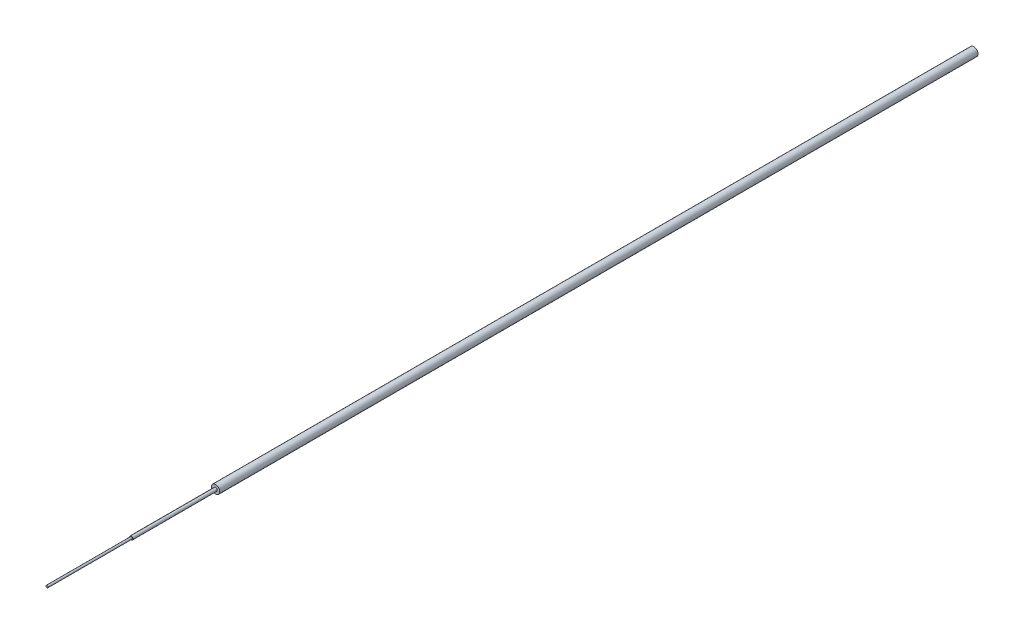
ISO-10303-21;
HEADER;
FILE_DESCRIPTION(('STEP AP214'),'2;1');
FILE_NAME('part.step','',(''),(''),'','','');
FILE_SCHEMA(('AUTOMOTIVE_DESIGN { 1 0 10303 214 1 1 1 1 }'));
ENDSEC;
DATA;
#1=APPLICATION_CONTEXT('core data for automotive mechanical design processes');
#2=APPLICATION_PROTOCOL_DEFINITION('international standard','automotive_design',2000,#1);
#3=PRODUCT_CONTEXT('',#1,'mechanical');
#4=PRODUCT('Part','Part','',(#3));
#5=PRODUCT_RELATED_PRODUCT_CATEGORY('part','',(#4));
#6=PRODUCT_DEFINITION_FORMATION('','',#4);
#7=PRODUCT_DEFINITION_CONTEXT('part definition',#1,'design');
#8=PRODUCT_DEFINITION('design','',#6,#7);
#9=PRODUCT_DEFINITION_SHAPE('','',#8);
#10=(LENGTH_UNIT() NAMED_UNIT(*) SI_UNIT(.MILLI.,.METRE.));
#11=(NAMED_UNIT(*) PLANE_ANGLE_UNIT() SI_UNIT($,.RADIAN.));
#12=(NAMED_UNIT(*) SI_UNIT($,.STERADIAN.) SOLID_ANGLE_UNIT());
#13=UNCERTAINTY_MEASURE_WITH_UNIT(LENGTH_MEASURE(1.E-05),#10,'distance_accuracy_value','');
#14=(GEOMETRIC_REPRESENTATION_CONTEXT(3) GLOBAL_UNCERTAINTY_ASSIGNED_CONTEXT((#13)) GLOBAL_UNIT_ASSIGNED_CONTEXT((#10,
#11,#12)) REPRESENTATION_CONTEXT('',''));
#15=CARTESIAN_POINT('',(0.,0.,0.));
#16=DIRECTION('',(0.,0.,1.));
#17=DIRECTION('',(1.,0.,0.));
#18=AXIS2_PLACEMENT_3D('',#15,#16,#17);
#19=CARTESIAN_POINT('',(1.38777878078145E-13,0.,89.9999999999996));
#20=DIRECTION('',(0.,0.,-0.999999999999999));
#21=DIRECTION('',(-0.999999999999999,0.,0.));
#22=AXIS2_PLACEMENT_3D('',#19,#20,#21);
#23=CYLINDRICAL_SURFACE('',#22,0.5);
#24=CARTESIAN_POINT('',(1.38777878078145E-13,0.,89.9999999999996));
#25=DIRECTION('',(0.,0.,0.999999999999999));
#26=DIRECTION('',(0.999999999999999,0.,0.));
#27=AXIS2_PLACEMENT_3D('',#24,#25,#26);
#28=CIRCLE('',#27,0.5);
#29=CARTESIAN_POINT('',(0.500000000000138,0.,89.9999999999996));
#30=VERTEX_POINT('',#29);
#31=EDGE_CURVE('E63',#30,#30,#28,.T.);
#32=ORIENTED_EDGE('',*,*,#31,.F.);
#33=EDGE_LOOP('',(#32));
#34=FACE_BOUND('',#33,.T.);
#35=CARTESIAN_POINT('',(0.,0.,0.));
#36=DIRECTION('',(0.,0.,0.999999999999999));
#37=DIRECTION('',(0.999999999999999,0.,0.));
#38=AXIS2_PLACEMENT_3D('',#35,#36,#37);
#39=CIRCLE('',#38,0.5);
#40=CARTESIAN_POINT('',(0.5,0.,0.));
#41=VERTEX_POINT('',#40);
#42=EDGE_CURVE('E51',#41,#41,#39,.T.);
#43=ORIENTED_EDGE('',*,*,#42,.T.);
#44=EDGE_LOOP('',(#43));
#45=FACE_BOUND('',#44,.T.);
#46=ADVANCED_FACE('F48',(#34,#45),#23,.T.);
#47=CARTESIAN_POINT('',(1.38777878078145E-13,0.,89.9999999999996));
#48=DIRECTION('',(0.,0.,0.999999999999999));
#49=DIRECTION('',(0.999999999999999,0.,0.));
#50=AXIS2_PLACEMENT_3D('',#47,#48,#49);
#51=PLANE('',#50);
#52=CARTESIAN_POINT('',(1.38777878078145E-13,0.,89.9999999999996));
#53=DIRECTION('',(0.,0.,0.999999999999999));
#54=DIRECTION('',(0.999999999999999,0.,0.));
#55=AXIS2_PLACEMENT_3D('',#52,#53,#54);
#56=CIRCLE('',#55,0.2);
#57=CARTESIAN_POINT('',(0.200000000000139,0.,89.9999999999996));
#58=VERTEX_POINT('',#57);
#59=EDGE_CURVE('E56',#58,#58,#56,.T.);
#60=ORIENTED_EDGE('',*,*,#59,.F.);
#61=EDGE_LOOP('',(#60));
#62=FACE_BOUND('',#61,.T.);
#63=ORIENTED_EDGE('',*,*,#31,.T.);
#64=EDGE_LOOP('',(#63));
#65=FACE_BOUND('',#64,.T.);
#66=ADVANCED_FACE('F85',(#62,#65),#51,.T.);
#67=CARTESIAN_POINT('',(0.,0.,0.));
#68=DIRECTION('',(0.,0.,0.999999999999999));
#69=DIRECTION('',(0.999999999999999,0.,0.));
#70=AXIS2_PLACEMENT_3D('',#67,#68,#69);
#71=PLANE('',#70);
#72=ORIENTED_EDGE('',*,*,#42,.F.);
#73=EDGE_LOOP('',(#72));
#74=FACE_BOUND('',#73,.T.);
#75=ADVANCED_FACE('F82',(#74),#71,.F.);
#76=CARTESIAN_POINT('',(0.,0.,99.9999999999997));
#77=DIRECTION('',(0.,0.,-0.999999999999999));
#78=DIRECTION('',(-0.999999999999999,0.,0.));
#79=AXIS2_PLACEMENT_3D('',#76,#77,#78);
#80=CYLINDRICAL_SURFACE('',#79,0.2);
#81=CARTESIAN_POINT('',(0.,0.,99.9999999999997));
#82=DIRECTION('',(0.,0.,0.999999999999999));
#83=DIRECTION('',(0.999999999999999,0.,0.));
#84=AXIS2_PLACEMENT_3D('',#81,#82,#83);
#85=CIRCLE('',#84,0.2);
#86=CARTESIAN_POINT('',(0.200000000000055,0.,99.9999999999997));
#87=VERTEX_POINT('',#86);
#88=EDGE_CURVE('E68',#87,#87,#85,.T.);
#89=ORIENTED_EDGE('',*,*,#88,.F.);
#90=EDGE_LOOP('',(#89));
#91=FACE_BOUND('',#90,.T.);
#92=ORIENTED_EDGE('',*,*,#59,.T.);
#93=EDGE_LOOP('',(#92));
#94=FACE_BOUND('',#93,.T.);
#95=ADVANCED_FACE('F84',(#91,#94),#80,.T.);
#96=CARTESIAN_POINT('',(0.,0.,99.9999999999997));
#97=DIRECTION('',(0.,0.,0.999999999999999));
#98=DIRECTION('',(0.999999999999999,0.,0.));
#99=AXIS2_PLACEMENT_3D('',#96,#97,#98);
#100=PLANE('',#99);
#101=CARTESIAN_POINT('',(0.,0.,99.9999999999997));
#102=DIRECTION('',(0.,0.,0.999999999999999));
#103=DIRECTION('',(0.999999999999999,0.,0.));
#104=AXIS2_PLACEMENT_3D('',#101,#102,#103);
#105=CIRCLE('',#104,0.125);
#106=CARTESIAN_POINT('',(0.125000000000055,0.,99.9999999999997));
#107=VERTEX_POINT('',#106);
#108=EDGE_CURVE('E12',#107,#107,#105,.T.);
#109=ORIENTED_EDGE('',*,*,#108,.F.);
#110=EDGE_LOOP('',(#109));
#111=FACE_BOUND('',#110,.T.);
#112=ORIENTED_EDGE('',*,*,#88,.T.);
#113=EDGE_LOOP('',(#112));
#114=FACE_BOUND('',#113,.T.);
#115=ADVANCED_FACE('F90',(#111,#114),#100,.T.);
#116=CARTESIAN_POINT('',(1.66533453693773E-13,1.28369537222284E-13,110.));
#117=DIRECTION('',(0.,0.,-0.999999999999999));
#118=DIRECTION('',(-0.999999999999999,0.,0.));
#119=AXIS2_PLACEMENT_3D('',#116,#117,#118);
#120=CYLINDRICAL_SURFACE('',#119,0.125);
#121=CARTESIAN_POINT('',(1.66533453693773E-13,1.28369537222284E-13,110.));
#122=DIRECTION('',(0.,0.,0.999999999999999));
#123=DIRECTION('',(0.999999999999999,0.,0.));
#124=AXIS2_PLACEMENT_3D('',#121,#122,#123);
#125=CIRCLE('',#124,0.125);
#126=CARTESIAN_POINT('',(0.125000000000166,1.28404231691803E-13,110.));
#127=VERTEX_POINT('',#126);
#128=EDGE_CURVE('E67',#127,#127,#125,.T.);
#129=ORIENTED_EDGE('',*,*,#128,.F.);
#130=EDGE_LOOP('',(#129));
#131=FACE_BOUND('',#130,.T.);
#132=ORIENTED_EDGE('',*,*,#108,.T.);
#133=EDGE_LOOP('',(#132));
#134=FACE_BOUND('',#133,.T.);
#135=ADVANCED_FACE('F122',(#131,#134),#120,.T.);
#136=CARTESIAN_POINT('',(1.66533453693773E-13,1.28369537222284E-13,110.));
#137=DIRECTION('',(0.,0.,0.999999999999999));
#138=DIRECTION('',(0.999999999999999,0.,0.));
#139=AXIS2_PLACEMENT_3D('',#136,#137,#138);
#140=PLANE('',#139);
#141=ORIENTED_EDGE('',*,*,#128,.T.);
#142=EDGE_LOOP('',(#141));
#143=FACE_BOUND('',#142,.T.);
#144=ADVANCED_FACE('F132',(#143),#140,.T.);
#145=CLOSED_SHELL('',(#46,#66,#75,#95,#115,#135,#144));
#146=MANIFOLD_SOLID_BREP('B2',#145);
#147=ADVANCED_BREP_SHAPE_REPRESENTATION('',(#18,#146),#14);
#148=SHAPE_DEFINITION_REPRESENTATION(#9,#147);
ENDSEC;
END-ISO-10303-21;
